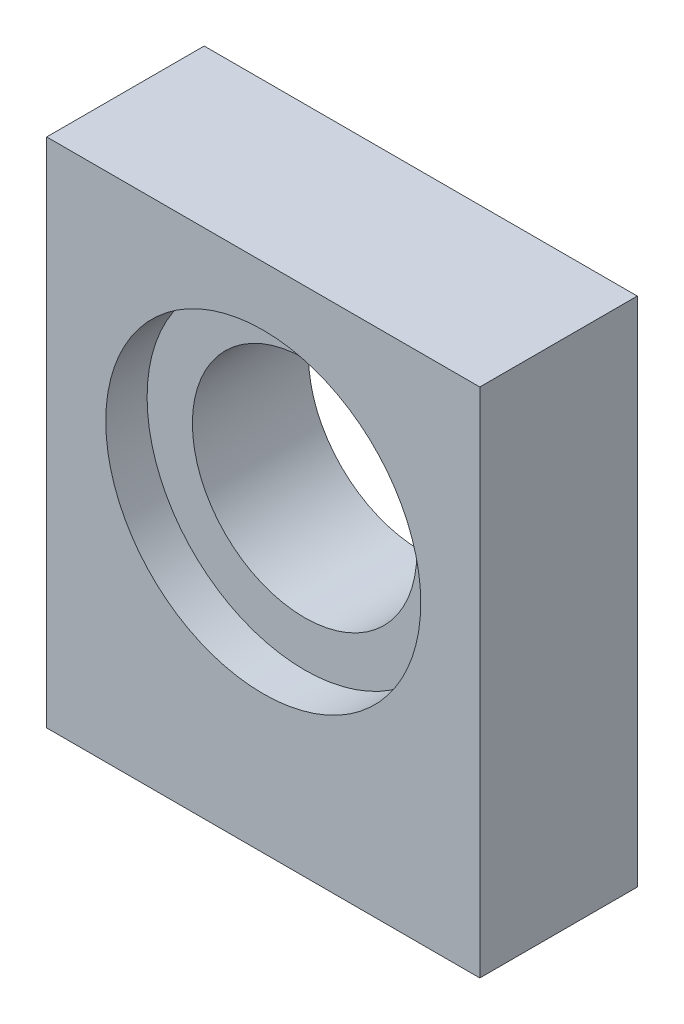
ISO-10303-21;
HEADER;
FILE_DESCRIPTION(('STEP AP214'),'2;1');
FILE_NAME('part.step','',(''),(''),'','','');
FILE_SCHEMA(('AUTOMOTIVE_DESIGN { 1 0 10303 214 1 1 1 1 }'));
ENDSEC;
DATA;
#1=APPLICATION_CONTEXT('core data for automotive mechanical design processes');
#2=APPLICATION_PROTOCOL_DEFINITION('international standard','automotive_design',2000,#1);
#3=PRODUCT_CONTEXT('',#1,'mechanical');
#4=PRODUCT('Part','Part','',(#3));
#5=PRODUCT_RELATED_PRODUCT_CATEGORY('part','',(#4));
#6=PRODUCT_DEFINITION_FORMATION('','',#4);
#7=PRODUCT_DEFINITION_CONTEXT('part definition',#1,'design');
#8=PRODUCT_DEFINITION('design','',#6,#7);
#9=PRODUCT_DEFINITION_SHAPE('','',#8);
#10=(LENGTH_UNIT() NAMED_UNIT(*) SI_UNIT(.MILLI.,.METRE.));
#11=(NAMED_UNIT(*) PLANE_ANGLE_UNIT() SI_UNIT($,.RADIAN.));
#12=(NAMED_UNIT(*) SI_UNIT($,.STERADIAN.) SOLID_ANGLE_UNIT());
#13=UNCERTAINTY_MEASURE_WITH_UNIT(LENGTH_MEASURE(1.E-05),#10,'distance_accuracy_value','');
#14=(GEOMETRIC_REPRESENTATION_CONTEXT(3) GLOBAL_UNCERTAINTY_ASSIGNED_CONTEXT((#13)) GLOBAL_UNIT_ASSIGNED_CONTEXT((#10,
#11,#12)) REPRESENTATION_CONTEXT('',''));
#15=CARTESIAN_POINT('',(0.,0.,0.));
#16=DIRECTION('',(0.,0.,1.));
#17=DIRECTION('',(1.,0.,0.));
#18=AXIS2_PLACEMENT_3D('',#15,#16,#17);
#19=CARTESIAN_POINT('',(0.,0.,8.));
#20=DIRECTION('',(0.,0.,-1.));
#21=DIRECTION('',(-1.,0.,0.));
#22=AXIS2_PLACEMENT_3D('',#19,#20,#21);
#23=PLANE('',#22);
#24=DIRECTION('',(0.,-1.,0.));
#25=VECTOR('',#24,1.);
#26=CARTESIAN_POINT('',(0.,0.,8.));
#27=LINE('',#26,#25);
#28=CARTESIAN_POINT('',(0.,26.,8.));
#29=VERTEX_POINT('',#28);
#30=CARTESIAN_POINT('',(0.,0.,8.));
#31=VERTEX_POINT('',#30);
#32=EDGE_CURVE('E129',#29,#31,#27,.T.);
#33=ORIENTED_EDGE('',*,*,#32,.T.);
#34=DIRECTION('',(1.,0.,0.));
#35=VECTOR('',#34,1.);
#36=CARTESIAN_POINT('',(0.,0.,8.));
#37=LINE('',#36,#35);
#38=CARTESIAN_POINT('',(22.,0.,8.));
#39=VERTEX_POINT('',#38);
#40=EDGE_CURVE('E82',#31,#39,#37,.T.);
#41=ORIENTED_EDGE('',*,*,#40,.T.);
#42=DIRECTION('',(0.,1.,0.));
#43=VECTOR('',#42,1.);
#44=CARTESIAN_POINT('',(22.,0.,8.));
#45=LINE('',#44,#43);
#46=CARTESIAN_POINT('',(22.,26.,8.));
#47=VERTEX_POINT('',#46);
#48=EDGE_CURVE('E132',#39,#47,#45,.T.);
#49=ORIENTED_EDGE('',*,*,#48,.T.);
#50=DIRECTION('',(-1.,0.,0.));
#51=VECTOR('',#50,1.);
#52=CARTESIAN_POINT('',(0.,26.,8.));
#53=LINE('',#52,#51);
#54=EDGE_CURVE('E51',#47,#29,#53,.T.);
#55=ORIENTED_EDGE('',*,*,#54,.T.);
#56=EDGE_LOOP('',(#33,#41,#49,#55));
#57=FACE_BOUND('',#56,.T.);
#58=CARTESIAN_POINT('',(11.,15.,8.));
#59=DIRECTION('',(0.,0.,-1.));
#60=DIRECTION('',(-1.,0.,0.));
#61=AXIS2_PLACEMENT_3D('',#58,#59,#60);
#62=CIRCLE('',#61,8.);
#63=CARTESIAN_POINT('',(3.,15.,8.));
#64=VERTEX_POINT('',#63);
#65=EDGE_CURVE('E119',#64,#64,#62,.T.);
#66=ORIENTED_EDGE('',*,*,#65,.T.);
#67=EDGE_LOOP('',(#66));
#68=FACE_BOUND('',#67,.T.);
#69=ADVANCED_FACE('F33',(#57,#68),#23,.F.);
#70=CARTESIAN_POINT('',(0.,0.,0.));
#71=DIRECTION('',(0.,0.,-1.));
#72=DIRECTION('',(-1.,0.,0.));
#73=AXIS2_PLACEMENT_3D('',#70,#71,#72);
#74=PLANE('',#73);
#75=DIRECTION('',(0.,-1.,0.));
#76=VECTOR('',#75,1.);
#77=CARTESIAN_POINT('',(0.,0.,0.));
#78=LINE('',#77,#76);
#79=CARTESIAN_POINT('',(0.,26.,0.));
#80=VERTEX_POINT('',#79);
#81=CARTESIAN_POINT('',(0.,0.,0.));
#82=VERTEX_POINT('',#81);
#83=EDGE_CURVE('E128',#80,#82,#78,.T.);
#84=ORIENTED_EDGE('',*,*,#83,.F.);
#85=DIRECTION('',(-1.,0.,0.));
#86=VECTOR('',#85,1.);
#87=CARTESIAN_POINT('',(0.,26.,0.));
#88=LINE('',#87,#86);
#89=CARTESIAN_POINT('',(22.,26.,0.));
#90=VERTEX_POINT('',#89);
#91=EDGE_CURVE('E75',#90,#80,#88,.T.);
#92=ORIENTED_EDGE('',*,*,#91,.F.);
#93=DIRECTION('',(0.,1.,0.));
#94=VECTOR('',#93,1.);
#95=CARTESIAN_POINT('',(22.,0.,0.));
#96=LINE('',#95,#94);
#97=CARTESIAN_POINT('',(22.,0.,0.));
#98=VERTEX_POINT('',#97);
#99=EDGE_CURVE('E69',#98,#90,#96,.T.);
#100=ORIENTED_EDGE('',*,*,#99,.F.);
#101=DIRECTION('',(1.,0.,0.));
#102=VECTOR('',#101,1.);
#103=CARTESIAN_POINT('',(0.,0.,0.));
#104=LINE('',#103,#102);
#105=EDGE_CURVE('E138',#82,#98,#104,.T.);
#106=ORIENTED_EDGE('',*,*,#105,.F.);
#107=EDGE_LOOP('',(#84,#92,#100,#106));
#108=FACE_BOUND('',#107,.T.);
#109=CARTESIAN_POINT('',(11.,15.,0.));
#110=DIRECTION('',(0.,0.,1.));
#111=DIRECTION('',(1.,0.,0.));
#112=AXIS2_PLACEMENT_3D('',#109,#110,#111);
#113=CIRCLE('',#112,5.7);
#114=CARTESIAN_POINT('',(16.7,15.,0.));
#115=VERTEX_POINT('',#114);
#116=EDGE_CURVE('E125',#115,#115,#113,.T.);
#117=ORIENTED_EDGE('',*,*,#116,.T.);
#118=EDGE_LOOP('',(#117));
#119=FACE_BOUND('',#118,.T.);
#120=ADVANCED_FACE('F149',(#108,#119),#74,.T.);
#121=CARTESIAN_POINT('',(0.,0.,8.));
#122=DIRECTION('',(1.,0.,0.));
#123=DIRECTION('',(0.,0.,-1.));
#124=AXIS2_PLACEMENT_3D('',#121,#122,#123);
#125=PLANE('',#124);
#126=ORIENTED_EDGE('',*,*,#83,.T.);
#127=DIRECTION('',(0.,0.,-1.));
#128=VECTOR('',#127,1.);
#129=CARTESIAN_POINT('',(0.,0.,8.));
#130=LINE('',#129,#128);
#131=EDGE_CURVE('E11',#31,#82,#130,.T.);
#132=ORIENTED_EDGE('',*,*,#131,.F.);
#133=ORIENTED_EDGE('',*,*,#32,.F.);
#134=DIRECTION('',(0.,0.,-1.));
#135=VECTOR('',#134,1.);
#136=CARTESIAN_POINT('',(0.,26.,8.));
#137=LINE('',#136,#135);
#138=EDGE_CURVE('E135',#29,#80,#137,.T.);
#139=ORIENTED_EDGE('',*,*,#138,.T.);
#140=EDGE_LOOP('',(#126,#132,#133,#139));
#141=FACE_BOUND('',#140,.T.);
#142=ADVANCED_FACE('F35',(#141),#125,.F.);
#143=CARTESIAN_POINT('',(0.,0.,8.));
#144=DIRECTION('',(0.,1.,0.));
#145=DIRECTION('',(0.,0.,1.));
#146=AXIS2_PLACEMENT_3D('',#143,#144,#145);
#147=PLANE('',#146);
#148=CARTESIAN_POINT('',(4.,0.,5.5));
#149=DIRECTION('',(0.,-1.,0.));
#150=DIRECTION('',(0.,0.,-1.));
#151=AXIS2_PLACEMENT_3D('',#148,#149,#150);
#152=CIRCLE('',#151,1.25);
#153=CARTESIAN_POINT('',(4.,0.,4.25));
#154=VERTEX_POINT('',#153);
#155=EDGE_CURVE('E103',#154,#154,#152,.T.);
#156=ORIENTED_EDGE('',*,*,#155,.F.);
#157=EDGE_LOOP('',(#156));
#158=FACE_BOUND('',#157,.T.);
#159=CARTESIAN_POINT('',(18.,0.,5.5));
#160=DIRECTION('',(0.,-1.,0.));
#161=DIRECTION('',(0.,0.,-1.));
#162=AXIS2_PLACEMENT_3D('',#159,#160,#161);
#163=CIRCLE('',#162,1.25);
#164=CARTESIAN_POINT('',(18.,0.,4.25));
#165=VERTEX_POINT('',#164);
#166=EDGE_CURVE('E102',#165,#165,#163,.T.);
#167=ORIENTED_EDGE('',*,*,#166,.F.);
#168=EDGE_LOOP('',(#167));
#169=FACE_BOUND('',#168,.T.);
#170=CARTESIAN_POINT('',(11.,0.,2.5));
#171=DIRECTION('',(0.,-1.,0.));
#172=DIRECTION('',(0.,0.,-1.));
#173=AXIS2_PLACEMENT_3D('',#170,#171,#172);
#174=CIRCLE('',#173,1.25);
#175=CARTESIAN_POINT('',(11.,0.,1.25));
#176=VERTEX_POINT('',#175);
#177=EDGE_CURVE('E113',#176,#176,#174,.T.);
#178=ORIENTED_EDGE('',*,*,#177,.F.);
#179=EDGE_LOOP('',(#178));
#180=FACE_BOUND('',#179,.T.);
#181=ORIENTED_EDGE('',*,*,#105,.T.);
#182=DIRECTION('',(0.,0.,-1.));
#183=VECTOR('',#182,1.);
#184=CARTESIAN_POINT('',(22.,0.,8.));
#185=LINE('',#184,#183);
#186=EDGE_CURVE('E43',#39,#98,#185,.T.);
#187=ORIENTED_EDGE('',*,*,#186,.F.);
#188=ORIENTED_EDGE('',*,*,#40,.F.);
#189=ORIENTED_EDGE('',*,*,#131,.T.);
#190=EDGE_LOOP('',(#181,#187,#188,#189));
#191=FACE_BOUND('',#190,.T.);
#192=ADVANCED_FACE('F165',(#158,#169,#180,#191),#147,.F.);
#193=CARTESIAN_POINT('',(22.,0.,8.));
#194=DIRECTION('',(-1.,0.,0.));
#195=DIRECTION('',(0.,0.,1.));
#196=AXIS2_PLACEMENT_3D('',#193,#194,#195);
#197=PLANE('',#196);
#198=ORIENTED_EDGE('',*,*,#99,.T.);
#199=DIRECTION('',(0.,0.,-1.));
#200=VECTOR('',#199,1.);
#201=CARTESIAN_POINT('',(22.,26.,8.));
#202=LINE('',#201,#200);
#203=EDGE_CURVE('E143',#47,#90,#202,.T.);
#204=ORIENTED_EDGE('',*,*,#203,.F.);
#205=ORIENTED_EDGE('',*,*,#48,.F.);
#206=ORIENTED_EDGE('',*,*,#186,.T.);
#207=EDGE_LOOP('',(#198,#204,#205,#206));
#208=FACE_BOUND('',#207,.T.);
#209=ADVANCED_FACE('F146',(#208),#197,.F.);
#210=CARTESIAN_POINT('',(0.,26.,8.));
#211=DIRECTION('',(0.,-1.,0.));
#212=DIRECTION('',(0.,0.,-1.));
#213=AXIS2_PLACEMENT_3D('',#210,#211,#212);
#214=PLANE('',#213);
#215=ORIENTED_EDGE('',*,*,#91,.T.);
#216=ORIENTED_EDGE('',*,*,#138,.F.);
#217=ORIENTED_EDGE('',*,*,#54,.F.);
#218=ORIENTED_EDGE('',*,*,#203,.T.);
#219=EDGE_LOOP('',(#215,#216,#217,#218));
#220=FACE_BOUND('',#219,.T.);
#221=ADVANCED_FACE('F154',(#220),#214,.F.);
#222=CARTESIAN_POINT('',(11.,15.,8.));
#223=DIRECTION('',(0.,0.,-1.));
#224=DIRECTION('',(-1.,0.,0.));
#225=AXIS2_PLACEMENT_3D('',#222,#223,#224);
#226=CYLINDRICAL_SURFACE('',#225,5.7);
#227=CARTESIAN_POINT('',(11.,15.,5.9));
#228=DIRECTION('',(0.,0.,-1.));
#229=DIRECTION('',(-1.,0.,0.));
#230=AXIS2_PLACEMENT_3D('',#227,#228,#229);
#231=CIRCLE('',#230,5.7);
#232=CARTESIAN_POINT('',(5.3,15.,5.9));
#233=VERTEX_POINT('',#232);
#234=EDGE_CURVE('E37',#233,#233,#231,.T.);
#235=ORIENTED_EDGE('',*,*,#234,.F.);
#236=EDGE_LOOP('',(#235));
#237=FACE_BOUND('',#236,.T.);
#238=ORIENTED_EDGE('',*,*,#116,.F.);
#239=EDGE_LOOP('',(#238));
#240=FACE_BOUND('',#239,.T.);
#241=ADVANCED_FACE('F156',(#237,#240),#226,.F.);
#242=CARTESIAN_POINT('',(11.,15.,5.9));
#243=DIRECTION('',(0.,0.,1.));
#244=DIRECTION('',(1.,0.,0.));
#245=AXIS2_PLACEMENT_3D('',#242,#243,#244);
#246=CYLINDRICAL_SURFACE('',#245,8.);
#247=CARTESIAN_POINT('',(11.,15.,5.9));
#248=DIRECTION('',(0.,0.,-1.));
#249=DIRECTION('',(-1.,0.,0.));
#250=AXIS2_PLACEMENT_3D('',#247,#248,#249);
#251=CIRCLE('',#250,8.);
#252=CARTESIAN_POINT('',(3.,15.,5.9));
#253=VERTEX_POINT('',#252);
#254=EDGE_CURVE('E120',#253,#253,#251,.T.);
#255=ORIENTED_EDGE('',*,*,#254,.T.);
#256=EDGE_LOOP('',(#255));
#257=FACE_BOUND('',#256,.T.);
#258=ORIENTED_EDGE('',*,*,#65,.F.);
#259=EDGE_LOOP('',(#258));
#260=FACE_BOUND('',#259,.T.);
#261=ADVANCED_FACE('F162',(#257,#260),#246,.F.);
#262=CARTESIAN_POINT('',(11.,15.,5.9));
#263=DIRECTION('',(0.,0.,-1.));
#264=DIRECTION('',(-1.,0.,0.));
#265=AXIS2_PLACEMENT_3D('',#262,#263,#264);
#266=PLANE('',#265);
#267=ORIENTED_EDGE('',*,*,#234,.T.);
#268=EDGE_LOOP('',(#267));
#269=FACE_BOUND('',#268,.T.);
#270=ORIENTED_EDGE('',*,*,#254,.F.);
#271=EDGE_LOOP('',(#270));
#272=FACE_BOUND('',#271,.T.);
#273=ADVANCED_FACE('F177',(#269,#272),#266,.F.);
#274=CARTESIAN_POINT('',(11.,5.,2.5));
#275=DIRECTION('',(0.,-1.,0.));
#276=DIRECTION('',(0.,0.,-1.));
#277=AXIS2_PLACEMENT_3D('',#274,#275,#276);
#278=CONICAL_SURFACE('',#277,1.25,1.02974425867665);
#279=CARTESIAN_POINT('',(11.,5.75107577378445,2.5));
#280=VERTEX_POINT('',#279);
#281=VERTEX_LOOP('',#280);
#282=FACE_BOUND('',#281,.T.);
#283=CARTESIAN_POINT('',(11.,5.,2.5));
#284=DIRECTION('',(0.,-1.,0.));
#285=DIRECTION('',(0.,0.,-1.));
#286=AXIS2_PLACEMENT_3D('',#283,#284,#285);
#287=CIRCLE('',#286,1.25);
#288=CARTESIAN_POINT('',(11.,5.,1.25));
#289=VERTEX_POINT('',#288);
#290=EDGE_CURVE('E116',#289,#289,#287,.T.);
#291=ORIENTED_EDGE('',*,*,#290,.T.);
#292=EDGE_LOOP('',(#291));
#293=FACE_BOUND('',#292,.T.);
#294=ADVANCED_FACE('F181',(#282,#293),#278,.F.);
#295=CARTESIAN_POINT('',(11.,0.,2.5));
#296=DIRECTION('',(0.,-1.,0.));
#297=DIRECTION('',(0.,0.,-1.));
#298=AXIS2_PLACEMENT_3D('',#295,#296,#297);
#299=CYLINDRICAL_SURFACE('',#298,1.25);
#300=ORIENTED_EDGE('',*,*,#290,.F.);
#301=EDGE_LOOP('',(#300));
#302=FACE_BOUND('',#301,.T.);
#303=ORIENTED_EDGE('',*,*,#177,.T.);
#304=EDGE_LOOP('',(#303));
#305=FACE_BOUND('',#304,.T.);
#306=ADVANCED_FACE('F185',(#302,#305),#299,.F.);
#307=CARTESIAN_POINT('',(18.,5.,5.5));
#308=DIRECTION('',(0.,-1.,0.));
#309=DIRECTION('',(0.,0.,-1.));
#310=AXIS2_PLACEMENT_3D('',#307,#308,#309);
#311=CONICAL_SURFACE('',#310,1.25,1.02974425867665);
#312=CARTESIAN_POINT('',(18.,5.75107577378445,5.5));
#313=VERTEX_POINT('',#312);
#314=VERTEX_LOOP('',#313);
#315=FACE_BOUND('',#314,.T.);
#316=CARTESIAN_POINT('',(18.,5.,5.5));
#317=DIRECTION('',(0.,-1.,0.));
#318=DIRECTION('',(0.,0.,-1.));
#319=AXIS2_PLACEMENT_3D('',#316,#317,#318);
#320=CIRCLE('',#319,1.25);
#321=CARTESIAN_POINT('',(18.,5.,4.25));
#322=VERTEX_POINT('',#321);
#323=EDGE_CURVE('E106',#322,#322,#320,.T.);
#324=ORIENTED_EDGE('',*,*,#323,.T.);
#325=EDGE_LOOP('',(#324));
#326=FACE_BOUND('',#325,.T.);
#327=ADVANCED_FACE('F189',(#315,#326),#311,.F.);
#328=CARTESIAN_POINT('',(18.,0.,5.5));
#329=DIRECTION('',(0.,-1.,0.));
#330=DIRECTION('',(0.,0.,-1.));
#331=AXIS2_PLACEMENT_3D('',#328,#329,#330);
#332=CYLINDRICAL_SURFACE('',#331,1.25);
#333=ORIENTED_EDGE('',*,*,#323,.F.);
#334=EDGE_LOOP('',(#333));
#335=FACE_BOUND('',#334,.T.);
#336=ORIENTED_EDGE('',*,*,#166,.T.);
#337=EDGE_LOOP('',(#336));
#338=FACE_BOUND('',#337,.T.);
#339=ADVANCED_FACE('F96',(#335,#338),#332,.F.);
#340=CARTESIAN_POINT('',(4.,5.,5.5));
#341=DIRECTION('',(0.,-1.,0.));
#342=DIRECTION('',(0.,0.,-1.));
#343=AXIS2_PLACEMENT_3D('',#340,#341,#342);
#344=CONICAL_SURFACE('',#343,1.25,1.02974425867665);
#345=CARTESIAN_POINT('',(4.,5.75107577378445,5.5));
#346=VERTEX_POINT('',#345);
#347=VERTEX_LOOP('',#346);
#348=FACE_BOUND('',#347,.T.);
#349=CARTESIAN_POINT('',(4.,5.,5.5));
#350=DIRECTION('',(0.,-1.,0.));
#351=DIRECTION('',(0.,0.,-1.));
#352=AXIS2_PLACEMENT_3D('',#349,#350,#351);
#353=CIRCLE('',#352,1.25);
#354=CARTESIAN_POINT('',(4.,5.,4.25));
#355=VERTEX_POINT('',#354);
#356=EDGE_CURVE('E100',#355,#355,#353,.T.);
#357=ORIENTED_EDGE('',*,*,#356,.T.);
#358=EDGE_LOOP('',(#357));
#359=FACE_BOUND('',#358,.T.);
#360=ADVANCED_FACE('F92',(#348,#359),#344,.F.);
#361=CARTESIAN_POINT('',(4.,0.,5.5));
#362=DIRECTION('',(0.,-1.,0.));
#363=DIRECTION('',(0.,0.,-1.));
#364=AXIS2_PLACEMENT_3D('',#361,#362,#363);
#365=CYLINDRICAL_SURFACE('',#364,1.25);
#366=ORIENTED_EDGE('',*,*,#356,.F.);
#367=EDGE_LOOP('',(#366));
#368=FACE_BOUND('',#367,.T.);
#369=ORIENTED_EDGE('',*,*,#155,.T.);
#370=EDGE_LOOP('',(#369));
#371=FACE_BOUND('',#370,.T.);
#372=ADVANCED_FACE('F95',(#368,#371),#365,.F.);
#373=CLOSED_SHELL('',(#69,#120,#142,#192,#209,#221,#241,#261,#273,#294,#306,#327,#339,#360,#372));
#374=MANIFOLD_SOLID_BREP('B2',#373);
#375=ADVANCED_BREP_SHAPE_REPRESENTATION('',(#18,#374),#14);
#376=SHAPE_DEFINITION_REPRESENTATION(#9,#375);
ENDSEC;
END-ISO-10303-21;
